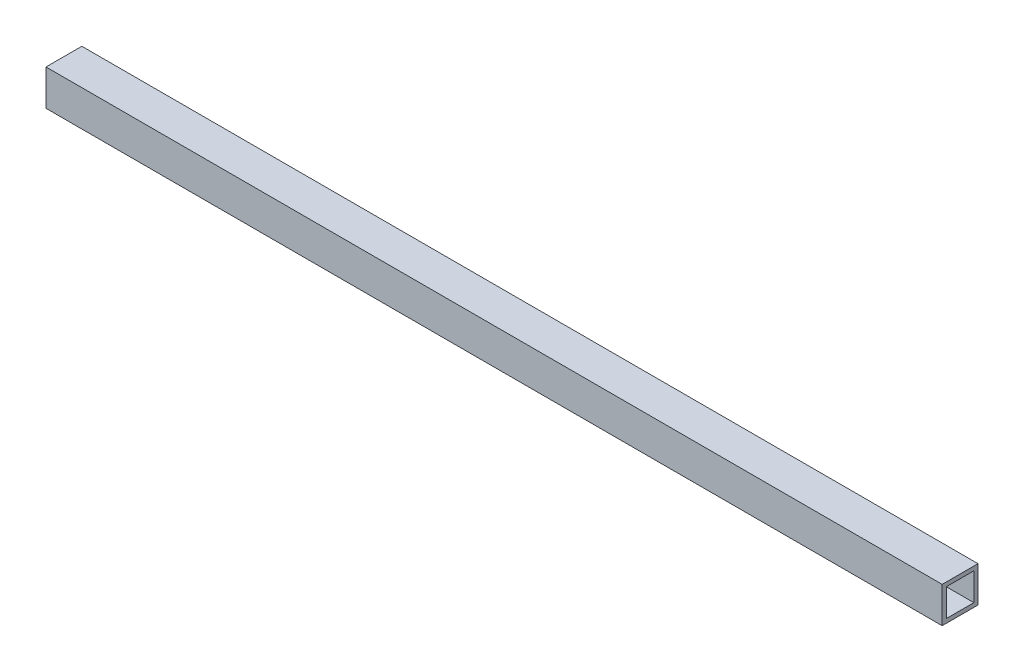
ISO-10303-21;
HEADER;
FILE_DESCRIPTION(('STEP AP214'),'2;1');
FILE_NAME('part.step','',(''),(''),'','','');
FILE_SCHEMA(('AUTOMOTIVE_DESIGN { 1 0 10303 214 1 1 1 1 }'));
ENDSEC;
DATA;
#1=APPLICATION_CONTEXT('core data for automotive mechanical design processes');
#2=APPLICATION_PROTOCOL_DEFINITION('international standard','automotive_design',2000,#1);
#3=PRODUCT_CONTEXT('',#1,'mechanical');
#4=PRODUCT('Part','Part','',(#3));
#5=PRODUCT_RELATED_PRODUCT_CATEGORY('part','',(#4));
#6=PRODUCT_DEFINITION_FORMATION('','',#4);
#7=PRODUCT_DEFINITION_CONTEXT('part definition',#1,'design');
#8=PRODUCT_DEFINITION('design','',#6,#7);
#9=PRODUCT_DEFINITION_SHAPE('','',#8);
#10=(LENGTH_UNIT() NAMED_UNIT(*) SI_UNIT(.MILLI.,.METRE.));
#11=(NAMED_UNIT(*) PLANE_ANGLE_UNIT() SI_UNIT($,.RADIAN.));
#12=(NAMED_UNIT(*) SI_UNIT($,.STERADIAN.) SOLID_ANGLE_UNIT());
#13=UNCERTAINTY_MEASURE_WITH_UNIT(LENGTH_MEASURE(1.E-05),#10,'distance_accuracy_value','');
#14=(GEOMETRIC_REPRESENTATION_CONTEXT(3) GLOBAL_UNCERTAINTY_ASSIGNED_CONTEXT((#13)) GLOBAL_UNIT_ASSIGNED_CONTEXT((#10,
#11,#12)) REPRESENTATION_CONTEXT('',''));
#15=CARTESIAN_POINT('',(0.,0.,0.));
#16=DIRECTION('',(0.,0.,1.));
#17=DIRECTION('',(1.,0.,0.));
#18=AXIS2_PLACEMENT_3D('',#15,#16,#17);
#19=CARTESIAN_POINT('',(325.,26.,-13.));
#20=DIRECTION('',(-1.,0.,0.));
#21=DIRECTION('',(0.,0.,1.));
#22=AXIS2_PLACEMENT_3D('',#19,#20,#21);
#23=PLANE('',#22);
#24=DIRECTION('',(0.,0.,-1.));
#25=VECTOR('',#24,1.);
#26=CARTESIAN_POINT('',(325.,0.,-13.));
#27=LINE('',#26,#25);
#28=CARTESIAN_POINT('',(325.,0.,13.));
#29=VERTEX_POINT('',#28);
#30=CARTESIAN_POINT('',(325.,0.,-13.));
#31=VERTEX_POINT('',#30);
#32=EDGE_CURVE('E127',#29,#31,#27,.T.);
#33=ORIENTED_EDGE('',*,*,#32,.T.);
#34=DIRECTION('',(0.,-1.,0.));
#35=VECTOR('',#34,1.);
#36=CARTESIAN_POINT('',(325.,26.,-13.));
#37=LINE('',#36,#35);
#38=CARTESIAN_POINT('',(325.,26.,-13.));
#39=VERTEX_POINT('',#38);
#40=EDGE_CURVE('E11',#39,#31,#37,.T.);
#41=ORIENTED_EDGE('',*,*,#40,.F.);
#42=DIRECTION('',(0.,0.,-1.));
#43=VECTOR('',#42,1.);
#44=CARTESIAN_POINT('',(325.,26.,-13.));
#45=LINE('',#44,#43);
#46=CARTESIAN_POINT('',(325.,26.,13.));
#47=VERTEX_POINT('',#46);
#48=EDGE_CURVE('E132',#47,#39,#45,.T.);
#49=ORIENTED_EDGE('',*,*,#48,.F.);
#50=DIRECTION('',(0.,-1.,0.));
#51=VECTOR('',#50,1.);
#52=CARTESIAN_POINT('',(325.,26.,13.));
#53=LINE('',#52,#51);
#54=EDGE_CURVE('E142',#47,#29,#53,.T.);
#55=ORIENTED_EDGE('',*,*,#54,.T.);
#56=EDGE_LOOP('',(#33,#41,#49,#55));
#57=FACE_BOUND('',#56,.T.);
#58=DIRECTION('',(0.,0.,-1.));
#59=VECTOR('',#58,1.);
#60=CARTESIAN_POINT('',(325.,3.,-13.));
#61=LINE('',#60,#59);
#62=CARTESIAN_POINT('',(325.,3.,10.));
#63=VERTEX_POINT('',#62);
#64=CARTESIAN_POINT('',(325.,3.,-10.));
#65=VERTEX_POINT('',#64);
#66=EDGE_CURVE('E103',#63,#65,#61,.T.);
#67=ORIENTED_EDGE('',*,*,#66,.F.);
#68=DIRECTION('',(0.,-1.,0.));
#69=VECTOR('',#68,1.);
#70=CARTESIAN_POINT('',(325.,26.,10.));
#71=LINE('',#70,#69);
#72=CARTESIAN_POINT('',(325.,23.,10.));
#73=VERTEX_POINT('',#72);
#74=EDGE_CURVE('E123',#73,#63,#71,.T.);
#75=ORIENTED_EDGE('',*,*,#74,.F.);
#76=DIRECTION('',(0.,0.,-1.));
#77=VECTOR('',#76,1.);
#78=CARTESIAN_POINT('',(325.,23.,-13.));
#79=LINE('',#78,#77);
#80=CARTESIAN_POINT('',(325.,23.,-10.));
#81=VERTEX_POINT('',#80);
#82=EDGE_CURVE('E47',#73,#81,#79,.T.);
#83=ORIENTED_EDGE('',*,*,#82,.T.);
#84=DIRECTION('',(0.,-1.,0.));
#85=VECTOR('',#84,1.);
#86=CARTESIAN_POINT('',(325.,26.,-10.));
#87=LINE('',#86,#85);
#88=EDGE_CURVE('E113',#81,#65,#87,.T.);
#89=ORIENTED_EDGE('',*,*,#88,.T.);
#90=EDGE_LOOP('',(#67,#75,#83,#89));
#91=FACE_BOUND('',#90,.T.);
#92=ADVANCED_FACE('F33',(#57,#91),#23,.F.);
#93=CARTESIAN_POINT('',(-325.,26.,-13.));
#94=DIRECTION('',(1.,0.,0.));
#95=DIRECTION('',(0.,0.,-1.));
#96=AXIS2_PLACEMENT_3D('',#93,#94,#95);
#97=PLANE('',#96);
#98=DIRECTION('',(0.,0.,1.));
#99=VECTOR('',#98,1.);
#100=CARTESIAN_POINT('',(-325.,0.,-13.));
#101=LINE('',#100,#99);
#102=CARTESIAN_POINT('',(-325.,0.,-13.));
#103=VERTEX_POINT('',#102);
#104=CARTESIAN_POINT('',(-325.,0.,13.));
#105=VERTEX_POINT('',#104);
#106=EDGE_CURVE('E147',#103,#105,#101,.T.);
#107=ORIENTED_EDGE('',*,*,#106,.T.);
#108=DIRECTION('',(0.,-1.,0.));
#109=VECTOR('',#108,1.);
#110=CARTESIAN_POINT('',(-325.,26.,13.));
#111=LINE('',#110,#109);
#112=CARTESIAN_POINT('',(-325.,26.,13.));
#113=VERTEX_POINT('',#112);
#114=EDGE_CURVE('E152',#113,#105,#111,.T.);
#115=ORIENTED_EDGE('',*,*,#114,.F.);
#116=DIRECTION('',(0.,0.,1.));
#117=VECTOR('',#116,1.);
#118=CARTESIAN_POINT('',(-325.,26.,-13.));
#119=LINE('',#118,#117);
#120=CARTESIAN_POINT('',(-325.,26.,-13.));
#121=VERTEX_POINT('',#120);
#122=EDGE_CURVE('E138',#121,#113,#119,.T.);
#123=ORIENTED_EDGE('',*,*,#122,.F.);
#124=DIRECTION('',(0.,-1.,0.));
#125=VECTOR('',#124,1.);
#126=CARTESIAN_POINT('',(-325.,26.,-13.));
#127=LINE('',#126,#125);
#128=EDGE_CURVE('E40',#121,#103,#127,.T.);
#129=ORIENTED_EDGE('',*,*,#128,.T.);
#130=EDGE_LOOP('',(#107,#115,#123,#129));
#131=FACE_BOUND('',#130,.T.);
#132=DIRECTION('',(0.,0.,1.));
#133=VECTOR('',#132,1.);
#134=CARTESIAN_POINT('',(-325.,3.,-13.));
#135=LINE('',#134,#133);
#136=CARTESIAN_POINT('',(-325.,3.,-10.));
#137=VERTEX_POINT('',#136);
#138=CARTESIAN_POINT('',(-325.,3.,10.));
#139=VERTEX_POINT('',#138);
#140=EDGE_CURVE('E100',#137,#139,#135,.T.);
#141=ORIENTED_EDGE('',*,*,#140,.F.);
#142=DIRECTION('',(0.,-1.,0.));
#143=VECTOR('',#142,1.);
#144=CARTESIAN_POINT('',(-325.,26.,-10.));
#145=LINE('',#144,#143);
#146=CARTESIAN_POINT('',(-325.,23.,-10.));
#147=VERTEX_POINT('',#146);
#148=EDGE_CURVE('E109',#147,#137,#145,.T.);
#149=ORIENTED_EDGE('',*,*,#148,.F.);
#150=DIRECTION('',(0.,0.,1.));
#151=VECTOR('',#150,1.);
#152=CARTESIAN_POINT('',(-325.,23.,-13.));
#153=LINE('',#152,#151);
#154=CARTESIAN_POINT('',(-325.,23.,10.));
#155=VERTEX_POINT('',#154);
#156=EDGE_CURVE('E52',#147,#155,#153,.T.);
#157=ORIENTED_EDGE('',*,*,#156,.T.);
#158=DIRECTION('',(0.,-1.,0.));
#159=VECTOR('',#158,1.);
#160=CARTESIAN_POINT('',(-325.,26.,10.));
#161=LINE('',#160,#159);
#162=EDGE_CURVE('E114',#155,#139,#161,.T.);
#163=ORIENTED_EDGE('',*,*,#162,.T.);
#164=EDGE_LOOP('',(#141,#149,#157,#163));
#165=FACE_BOUND('',#164,.T.);
#166=ADVANCED_FACE('F117',(#131,#165),#97,.F.);
#167=CARTESIAN_POINT('',(-325.,26.,-13.));
#168=DIRECTION('',(0.,0.,1.));
#169=DIRECTION('',(1.,0.,0.));
#170=AXIS2_PLACEMENT_3D('',#167,#168,#169);
#171=PLANE('',#170);
#172=DIRECTION('',(-1.,0.,0.));
#173=VECTOR('',#172,1.);
#174=CARTESIAN_POINT('',(-325.,0.,-13.));
#175=LINE('',#174,#173);
#176=EDGE_CURVE('E145',#31,#103,#175,.T.);
#177=ORIENTED_EDGE('',*,*,#176,.T.);
#178=ORIENTED_EDGE('',*,*,#128,.F.);
#179=DIRECTION('',(-1.,0.,0.));
#180=VECTOR('',#179,1.);
#181=CARTESIAN_POINT('',(-325.,26.,-13.));
#182=LINE('',#181,#180);
#183=EDGE_CURVE('E135',#39,#121,#182,.T.);
#184=ORIENTED_EDGE('',*,*,#183,.F.);
#185=ORIENTED_EDGE('',*,*,#40,.T.);
#186=EDGE_LOOP('',(#177,#178,#184,#185));
#187=FACE_BOUND('',#186,.T.);
#188=ADVANCED_FACE('F175',(#187),#171,.F.);
#189=CARTESIAN_POINT('',(-325.,26.,13.));
#190=DIRECTION('',(0.,0.,-1.));
#191=DIRECTION('',(-1.,0.,0.));
#192=AXIS2_PLACEMENT_3D('',#189,#190,#191);
#193=PLANE('',#192);
#194=DIRECTION('',(1.,0.,0.));
#195=VECTOR('',#194,1.);
#196=CARTESIAN_POINT('',(-325.,0.,13.));
#197=LINE('',#196,#195);
#198=EDGE_CURVE('E136',#105,#29,#197,.T.);
#199=ORIENTED_EDGE('',*,*,#198,.T.);
#200=ORIENTED_EDGE('',*,*,#54,.F.);
#201=DIRECTION('',(1.,0.,0.));
#202=VECTOR('',#201,1.);
#203=CARTESIAN_POINT('',(-325.,26.,13.));
#204=LINE('',#203,#202);
#205=EDGE_CURVE('E140',#113,#47,#204,.T.);
#206=ORIENTED_EDGE('',*,*,#205,.F.);
#207=ORIENTED_EDGE('',*,*,#114,.T.);
#208=EDGE_LOOP('',(#199,#200,#206,#207));
#209=FACE_BOUND('',#208,.T.);
#210=ADVANCED_FACE('F167',(#209),#193,.F.);
#211=CARTESIAN_POINT('',(0.,26.,0.));
#212=DIRECTION('',(0.,1.,0.));
#213=DIRECTION('',(0.,0.,1.));
#214=AXIS2_PLACEMENT_3D('',#211,#212,#213);
#215=PLANE('',#214);
#216=ORIENTED_EDGE('',*,*,#48,.T.);
#217=ORIENTED_EDGE('',*,*,#183,.T.);
#218=ORIENTED_EDGE('',*,*,#122,.T.);
#219=ORIENTED_EDGE('',*,*,#205,.T.);
#220=EDGE_LOOP('',(#216,#217,#218,#219));
#221=FACE_BOUND('',#220,.T.);
#222=ADVANCED_FACE('F174',(#221),#215,.T.);
#223=CARTESIAN_POINT('',(0.,0.,0.));
#224=DIRECTION('',(0.,1.,0.));
#225=DIRECTION('',(0.,0.,1.));
#226=AXIS2_PLACEMENT_3D('',#223,#224,#225);
#227=PLANE('',#226);
#228=ORIENTED_EDGE('',*,*,#32,.F.);
#229=ORIENTED_EDGE('',*,*,#198,.F.);
#230=ORIENTED_EDGE('',*,*,#106,.F.);
#231=ORIENTED_EDGE('',*,*,#176,.F.);
#232=EDGE_LOOP('',(#228,#229,#230,#231));
#233=FACE_BOUND('',#232,.T.);
#234=ADVANCED_FACE('F164',(#233),#227,.F.);
#235=CARTESIAN_POINT('',(-325.,26.,-10.));
#236=DIRECTION('',(0.,0.,1.));
#237=DIRECTION('',(1.,0.,0.));
#238=AXIS2_PLACEMENT_3D('',#235,#236,#237);
#239=PLANE('',#238);
#240=DIRECTION('',(-1.,0.,0.));
#241=VECTOR('',#240,1.);
#242=CARTESIAN_POINT('',(-325.,3.,-10.));
#243=LINE('',#242,#241);
#244=EDGE_CURVE('E96',#65,#137,#243,.T.);
#245=ORIENTED_EDGE('',*,*,#244,.F.);
#246=ORIENTED_EDGE('',*,*,#88,.F.);
#247=DIRECTION('',(-1.,0.,0.));
#248=VECTOR('',#247,1.);
#249=CARTESIAN_POINT('',(-325.,23.,-10.));
#250=LINE('',#249,#248);
#251=EDGE_CURVE('E111',#81,#147,#250,.T.);
#252=ORIENTED_EDGE('',*,*,#251,.T.);
#253=ORIENTED_EDGE('',*,*,#148,.T.);
#254=EDGE_LOOP('',(#245,#246,#252,#253));
#255=FACE_BOUND('',#254,.T.);
#256=ADVANCED_FACE('F110',(#255),#239,.T.);
#257=CARTESIAN_POINT('',(-325.,26.,10.));
#258=DIRECTION('',(0.,0.,-1.));
#259=DIRECTION('',(-1.,0.,0.));
#260=AXIS2_PLACEMENT_3D('',#257,#258,#259);
#261=PLANE('',#260);
#262=DIRECTION('',(1.,0.,0.));
#263=VECTOR('',#262,1.);
#264=CARTESIAN_POINT('',(-325.,3.,10.));
#265=LINE('',#264,#263);
#266=EDGE_CURVE('E118',#139,#63,#265,.T.);
#267=ORIENTED_EDGE('',*,*,#266,.F.);
#268=ORIENTED_EDGE('',*,*,#162,.F.);
#269=DIRECTION('',(1.,0.,0.));
#270=VECTOR('',#269,1.);
#271=CARTESIAN_POINT('',(-325.,23.,10.));
#272=LINE('',#271,#270);
#273=EDGE_CURVE('E125',#155,#73,#272,.T.);
#274=ORIENTED_EDGE('',*,*,#273,.T.);
#275=ORIENTED_EDGE('',*,*,#74,.T.);
#276=EDGE_LOOP('',(#267,#268,#274,#275));
#277=FACE_BOUND('',#276,.T.);
#278=ADVANCED_FACE('F201',(#277),#261,.T.);
#279=CARTESIAN_POINT('',(0.,23.,0.));
#280=DIRECTION('',(0.,1.,0.));
#281=DIRECTION('',(0.,0.,1.));
#282=AXIS2_PLACEMENT_3D('',#279,#280,#281);
#283=PLANE('',#282);
#284=ORIENTED_EDGE('',*,*,#82,.F.);
#285=ORIENTED_EDGE('',*,*,#273,.F.);
#286=ORIENTED_EDGE('',*,*,#156,.F.);
#287=ORIENTED_EDGE('',*,*,#251,.F.);
#288=EDGE_LOOP('',(#284,#285,#286,#287));
#289=FACE_BOUND('',#288,.T.);
#290=ADVANCED_FACE('F211',(#289),#283,.F.);
#291=CARTESIAN_POINT('',(0.,3.,0.));
#292=DIRECTION('',(0.,1.,0.));
#293=DIRECTION('',(0.,0.,1.));
#294=AXIS2_PLACEMENT_3D('',#291,#292,#293);
#295=PLANE('',#294);
#296=ORIENTED_EDGE('',*,*,#66,.T.);
#297=ORIENTED_EDGE('',*,*,#244,.T.);
#298=ORIENTED_EDGE('',*,*,#140,.T.);
#299=ORIENTED_EDGE('',*,*,#266,.T.);
#300=EDGE_LOOP('',(#296,#297,#298,#299));
#301=FACE_BOUND('',#300,.T.);
#302=ADVANCED_FACE('F98',(#301),#295,.T.);
#303=CLOSED_SHELL('',(#92,#166,#188,#210,#222,#234,#256,#278,#290,#302));
#304=MANIFOLD_SOLID_BREP('B2',#303);
#305=ADVANCED_BREP_SHAPE_REPRESENTATION('',(#18,#304),#14);
#306=SHAPE_DEFINITION_REPRESENTATION(#9,#305);
ENDSEC;
END-ISO-10303-21;
